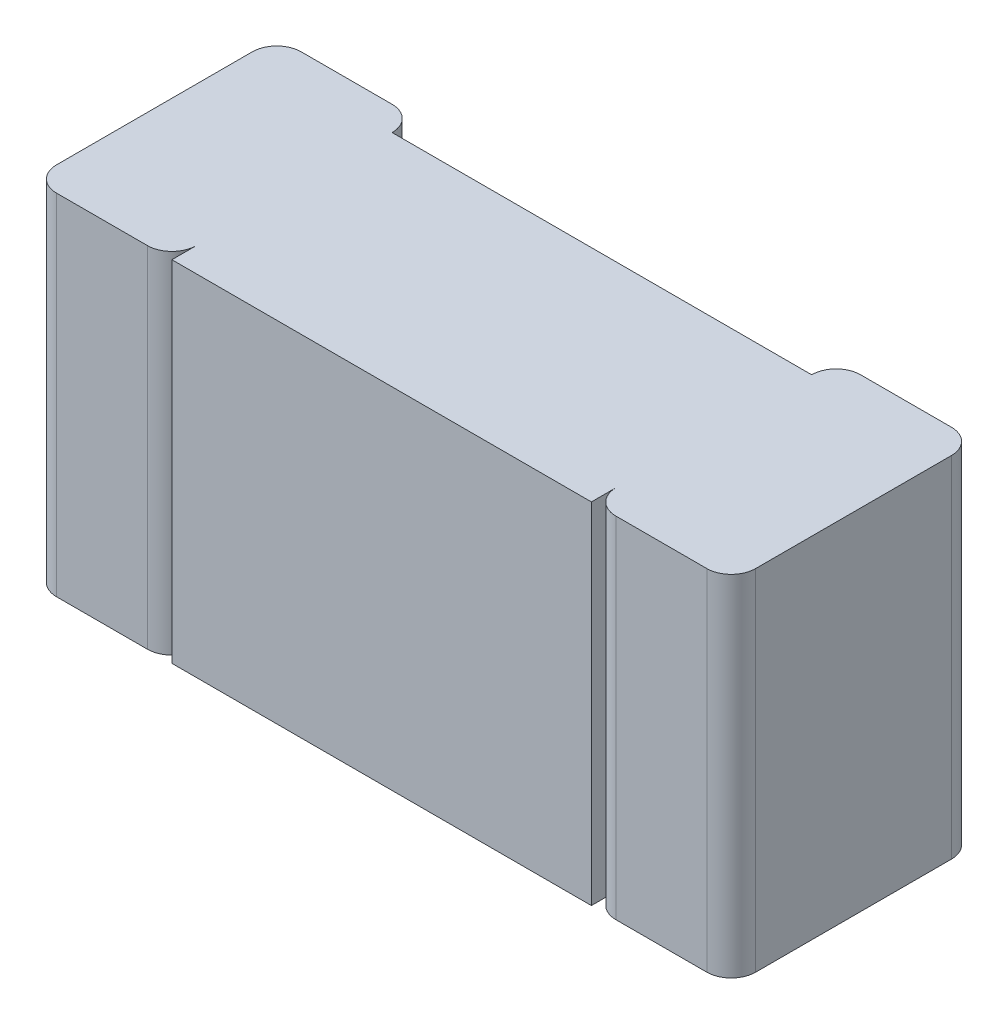
ISO-10303-21;
HEADER;
FILE_DESCRIPTION(('STEP AP214'),'2;1');
FILE_NAME('part.step','',(''),(''),'','','');
FILE_SCHEMA(('AUTOMOTIVE_DESIGN { 1 0 10303 214 1 1 1 1 }'));
ENDSEC;
DATA;
#1=APPLICATION_CONTEXT('core data for automotive mechanical design processes');
#2=APPLICATION_PROTOCOL_DEFINITION('international standard','automotive_design',2000,#1);
#3=PRODUCT_CONTEXT('',#1,'mechanical');
#4=PRODUCT('Part','Part','',(#3));
#5=PRODUCT_RELATED_PRODUCT_CATEGORY('part','',(#4));
#6=PRODUCT_DEFINITION_FORMATION('','',#4);
#7=PRODUCT_DEFINITION_CONTEXT('part definition',#1,'design');
#8=PRODUCT_DEFINITION('design','',#6,#7);
#9=PRODUCT_DEFINITION_SHAPE('','',#8);
#10=(LENGTH_UNIT() NAMED_UNIT(*) SI_UNIT(.MILLI.,.METRE.));
#11=(NAMED_UNIT(*) PLANE_ANGLE_UNIT() SI_UNIT($,.RADIAN.));
#12=(NAMED_UNIT(*) SI_UNIT($,.STERADIAN.) SOLID_ANGLE_UNIT());
#13=UNCERTAINTY_MEASURE_WITH_UNIT(LENGTH_MEASURE(1.E-05),#10,'distance_accuracy_value','');
#14=(GEOMETRIC_REPRESENTATION_CONTEXT(3) GLOBAL_UNCERTAINTY_ASSIGNED_CONTEXT((#13)) GLOBAL_UNIT_ASSIGNED_CONTEXT((#10,
#11,#12)) REPRESENTATION_CONTEXT('',''));
#15=CARTESIAN_POINT('',(0.,0.,0.));
#16=DIRECTION('',(0.,0.,1.));
#17=DIRECTION('',(1.,0.,0.));
#18=AXIS2_PLACEMENT_3D('',#15,#16,#17);
#19=CARTESIAN_POINT('',(-0.465,-0.25,0.035));
#20=DIRECTION('',(0.,1.,0.));
#21=DIRECTION('',(0.,0.,1.));
#22=AXIS2_PLACEMENT_3D('',#19,#20,#21);
#23=CYLINDRICAL_SURFACE('',#22,0.035);
#24=DIRECTION('',(0.,1.,0.));
#25=VECTOR('',#24,1.);
#26=CARTESIAN_POINT('',(-0.465,-0.25,0.));
#27=LINE('',#26,#25);
#28=CARTESIAN_POINT('',(-0.465,0.25,0.));
#29=VERTEX_POINT('',#28);
#30=CARTESIAN_POINT('',(-0.465,-0.25,0.));
#31=VERTEX_POINT('',#30);
#32=EDGE_CURVE('E129',#29,#31,#27,.F.);
#33=ORIENTED_EDGE('',*,*,#32,.T.);
#34=CARTESIAN_POINT('',(-0.465,-0.25,0.035));
#35=DIRECTION('',(0.,1.,0.));
#36=DIRECTION('',(0.,0.,1.));
#37=AXIS2_PLACEMENT_3D('',#34,#35,#36);
#38=CIRCLE('',#37,0.035);
#39=CARTESIAN_POINT('',(-0.5,-0.25,0.035));
#40=VERTEX_POINT('',#39);
#41=EDGE_CURVE('E20',#31,#40,#38,.T.);
#42=ORIENTED_EDGE('',*,*,#41,.T.);
#43=DIRECTION('',(0.,1.,0.));
#44=VECTOR('',#43,1.);
#45=CARTESIAN_POINT('',(-0.5,-0.25,0.035));
#46=LINE('',#45,#44);
#47=CARTESIAN_POINT('',(-0.5,0.25,0.035));
#48=VERTEX_POINT('',#47);
#49=EDGE_CURVE('E136',#40,#48,#46,.T.);
#50=ORIENTED_EDGE('',*,*,#49,.T.);
#51=CARTESIAN_POINT('',(-0.465,0.25,0.035));
#52=DIRECTION('',(0.,1.,0.));
#53=DIRECTION('',(0.,0.,1.));
#54=AXIS2_PLACEMENT_3D('',#51,#52,#53);
#55=CIRCLE('',#54,0.035);
#56=EDGE_CURVE('E232',#29,#48,#55,.T.);
#57=ORIENTED_EDGE('',*,*,#56,.F.);
#58=EDGE_LOOP('',(#33,#42,#50,#57));
#59=FACE_BOUND('',#58,.T.);
#60=ADVANCED_FACE('F17',(#59),#23,.T.);
#61=CARTESIAN_POINT('',(-0.5,-0.25,0.));
#62=DIRECTION('',(1.,0.,0.));
#63=DIRECTION('',(0.,0.,-1.));
#64=AXIS2_PLACEMENT_3D('',#61,#62,#63);
#65=PLANE('',#64);
#66=DIRECTION('',(0.,0.,1.));
#67=VECTOR('',#66,1.);
#68=CARTESIAN_POINT('',(-0.5,0.25,0.));
#69=LINE('',#68,#67);
#70=CARTESIAN_POINT('',(-0.5,0.25,0.315));
#71=VERTEX_POINT('',#70);
#72=EDGE_CURVE('E141',#48,#71,#69,.T.);
#73=ORIENTED_EDGE('',*,*,#72,.F.);
#74=ORIENTED_EDGE('',*,*,#49,.F.);
#75=DIRECTION('',(0.,0.,1.));
#76=VECTOR('',#75,1.);
#77=CARTESIAN_POINT('',(-0.5,-0.25,0.));
#78=LINE('',#77,#76);
#79=CARTESIAN_POINT('',(-0.5,-0.25,0.315));
#80=VERTEX_POINT('',#79);
#81=EDGE_CURVE('E140',#40,#80,#78,.T.);
#82=ORIENTED_EDGE('',*,*,#81,.T.);
#83=DIRECTION('',(0.,1.,0.));
#84=VECTOR('',#83,1.);
#85=CARTESIAN_POINT('',(-0.5,-0.25,0.315));
#86=LINE('',#85,#84);
#87=EDGE_CURVE('E142',#71,#80,#86,.F.);
#88=ORIENTED_EDGE('',*,*,#87,.F.);
#89=EDGE_LOOP('',(#73,#74,#82,#88));
#90=FACE_BOUND('',#89,.T.);
#91=ADVANCED_FACE('F138',(#90),#65,.F.);
#92=CARTESIAN_POINT('',(-0.465,-0.25,0.315));
#93=DIRECTION('',(0.,1.,0.));
#94=DIRECTION('',(0.,0.,1.));
#95=AXIS2_PLACEMENT_3D('',#92,#93,#94);
#96=CYLINDRICAL_SURFACE('',#95,0.035);
#97=CARTESIAN_POINT('',(-0.465,0.25,0.315));
#98=DIRECTION('',(0.,1.,0.));
#99=DIRECTION('',(0.,0.,1.));
#100=AXIS2_PLACEMENT_3D('',#97,#98,#99);
#101=CIRCLE('',#100,0.035);
#102=CARTESIAN_POINT('',(-0.465,0.25,0.35));
#103=VERTEX_POINT('',#102);
#104=EDGE_CURVE('E230',#71,#103,#101,.T.);
#105=ORIENTED_EDGE('',*,*,#104,.F.);
#106=ORIENTED_EDGE('',*,*,#87,.T.);
#107=CARTESIAN_POINT('',(-0.465,-0.25,0.315));
#108=DIRECTION('',(0.,1.,0.));
#109=DIRECTION('',(0.,0.,1.));
#110=AXIS2_PLACEMENT_3D('',#107,#108,#109);
#111=CIRCLE('',#110,0.035);
#112=CARTESIAN_POINT('',(-0.465,-0.25,0.35));
#113=VERTEX_POINT('',#112);
#114=EDGE_CURVE('E151',#80,#113,#111,.T.);
#115=ORIENTED_EDGE('',*,*,#114,.T.);
#116=DIRECTION('',(0.,1.,0.));
#117=VECTOR('',#116,1.);
#118=CARTESIAN_POINT('',(-0.465,-0.25,0.35));
#119=LINE('',#118,#117);
#120=EDGE_CURVE('E200',#103,#113,#119,.F.);
#121=ORIENTED_EDGE('',*,*,#120,.F.);
#122=EDGE_LOOP('',(#105,#106,#115,#121));
#123=FACE_BOUND('',#122,.T.);
#124=ADVANCED_FACE('F452',(#123),#96,.T.);
#125=CARTESIAN_POINT('',(-0.5,-0.25,0.35));
#126=DIRECTION('',(0.,0.,1.));
#127=DIRECTION('',(1.,0.,0.));
#128=AXIS2_PLACEMENT_3D('',#125,#126,#127);
#129=PLANE('',#128);
#130=DIRECTION('',(1.,0.,0.));
#131=VECTOR('',#130,1.);
#132=CARTESIAN_POINT('',(-0.5,-0.25,0.35));
#133=LINE('',#132,#131);
#134=CARTESIAN_POINT('',(-0.335,-0.25,0.35));
#135=VERTEX_POINT('',#134);
#136=EDGE_CURVE('E248',#113,#135,#133,.T.);
#137=ORIENTED_EDGE('',*,*,#136,.T.);
#138=DIRECTION('',(0.,1.,0.));
#139=VECTOR('',#138,1.);
#140=CARTESIAN_POINT('',(-0.335,-0.25,0.35));
#141=LINE('',#140,#139);
#142=CARTESIAN_POINT('',(-0.335,0.25,0.35));
#143=VERTEX_POINT('',#142);
#144=EDGE_CURVE('E198',#143,#135,#141,.F.);
#145=ORIENTED_EDGE('',*,*,#144,.F.);
#146=DIRECTION('',(1.,0.,0.));
#147=VECTOR('',#146,1.);
#148=CARTESIAN_POINT('',(-0.5,0.25,0.35));
#149=LINE('',#148,#147);
#150=EDGE_CURVE('E229',#103,#143,#149,.T.);
#151=ORIENTED_EDGE('',*,*,#150,.F.);
#152=ORIENTED_EDGE('',*,*,#120,.T.);
#153=EDGE_LOOP('',(#137,#145,#151,#152));
#154=FACE_BOUND('',#153,.T.);
#155=ADVANCED_FACE('F442',(#154),#129,.T.);
#156=CARTESIAN_POINT('',(-0.335,-0.25,0.315));
#157=DIRECTION('',(0.,1.,0.));
#158=DIRECTION('',(0.,0.,1.));
#159=AXIS2_PLACEMENT_3D('',#156,#157,#158);
#160=CYLINDRICAL_SURFACE('',#159,0.035);
#161=ORIENTED_EDGE('',*,*,#144,.T.);
#162=CARTESIAN_POINT('',(-0.335,-0.25,0.315));
#163=DIRECTION('',(0.,1.,0.));
#164=DIRECTION('',(0.,0.,1.));
#165=AXIS2_PLACEMENT_3D('',#162,#163,#164);
#166=CIRCLE('',#165,0.035);
#167=CARTESIAN_POINT('',(-0.3,-0.25,0.315));
#168=VERTEX_POINT('',#167);
#169=EDGE_CURVE('E246',#135,#168,#166,.T.);
#170=ORIENTED_EDGE('',*,*,#169,.T.);
#171=DIRECTION('',(0.,1.,0.));
#172=VECTOR('',#171,1.);
#173=CARTESIAN_POINT('',(-0.3,-0.25,0.315));
#174=LINE('',#173,#172);
#175=CARTESIAN_POINT('',(-0.3,0.25,0.315));
#176=VERTEX_POINT('',#175);
#177=EDGE_CURVE('E193',#168,#176,#174,.T.);
#178=ORIENTED_EDGE('',*,*,#177,.T.);
#179=CARTESIAN_POINT('',(-0.335,0.25,0.315));
#180=DIRECTION('',(0.,1.,0.));
#181=DIRECTION('',(0.,0.,1.));
#182=AXIS2_PLACEMENT_3D('',#179,#180,#181);
#183=CIRCLE('',#182,0.035);
#184=EDGE_CURVE('E227',#143,#176,#183,.T.);
#185=ORIENTED_EDGE('',*,*,#184,.F.);
#186=EDGE_LOOP('',(#161,#170,#178,#185));
#187=FACE_BOUND('',#186,.T.);
#188=ADVANCED_FACE('F430',(#187),#160,.T.);
#189=CARTESIAN_POINT('',(-0.3,-0.25,0.315));
#190=DIRECTION('',(1.,0.,0.));
#191=DIRECTION('',(0.,0.,-1.));
#192=AXIS2_PLACEMENT_3D('',#189,#190,#191);
#193=PLANE('',#192);
#194=DIRECTION('',(0.,0.,1.));
#195=VECTOR('',#194,1.);
#196=CARTESIAN_POINT('',(-0.3,0.25,0.315));
#197=LINE('',#196,#195);
#198=CARTESIAN_POINT('',(-0.3,0.25,0.35));
#199=VERTEX_POINT('',#198);
#200=EDGE_CURVE('E188',#176,#199,#197,.T.);
#201=ORIENTED_EDGE('',*,*,#200,.F.);
#202=ORIENTED_EDGE('',*,*,#177,.F.);
#203=DIRECTION('',(0.,0.,1.));
#204=VECTOR('',#203,1.);
#205=CARTESIAN_POINT('',(-0.3,-0.25,0.315));
#206=LINE('',#205,#204);
#207=CARTESIAN_POINT('',(-0.3,-0.25,0.35));
#208=VERTEX_POINT('',#207);
#209=EDGE_CURVE('E206',#168,#208,#206,.T.);
#210=ORIENTED_EDGE('',*,*,#209,.T.);
#211=DIRECTION('',(0.,1.,0.));
#212=VECTOR('',#211,1.);
#213=CARTESIAN_POINT('',(-0.3,-0.25,0.35));
#214=LINE('',#213,#212);
#215=EDGE_CURVE('E181',#199,#208,#214,.F.);
#216=ORIENTED_EDGE('',*,*,#215,.F.);
#217=EDGE_LOOP('',(#201,#202,#210,#216));
#218=FACE_BOUND('',#217,.T.);
#219=ADVANCED_FACE('F420',(#218),#193,.F.);
#220=CARTESIAN_POINT('',(-0.3,-0.25,0.35));
#221=DIRECTION('',(0.,0.,1.));
#222=DIRECTION('',(1.,0.,0.));
#223=AXIS2_PLACEMENT_3D('',#220,#221,#222);
#224=PLANE('',#223);
#225=DIRECTION('',(0.,1.,0.));
#226=VECTOR('',#225,1.);
#227=CARTESIAN_POINT('',(0.3,-0.25,0.35));
#228=LINE('',#227,#226);
#229=CARTESIAN_POINT('',(0.3,0.25,0.35));
#230=VERTEX_POINT('',#229);
#231=CARTESIAN_POINT('',(0.3,-0.25,0.35));
#232=VERTEX_POINT('',#231);
#233=EDGE_CURVE('E174',#230,#232,#228,.F.);
#234=ORIENTED_EDGE('',*,*,#233,.F.);
#235=DIRECTION('',(1.,0.,0.));
#236=VECTOR('',#235,1.);
#237=CARTESIAN_POINT('',(-0.3,0.25,0.35));
#238=LINE('',#237,#236);
#239=EDGE_CURVE('E184',#199,#230,#238,.T.);
#240=ORIENTED_EDGE('',*,*,#239,.F.);
#241=ORIENTED_EDGE('',*,*,#215,.T.);
#242=DIRECTION('',(1.,0.,0.));
#243=VECTOR('',#242,1.);
#244=CARTESIAN_POINT('',(-0.3,-0.25,0.35));
#245=LINE('',#244,#243);
#246=EDGE_CURVE('E203',#208,#232,#245,.T.);
#247=ORIENTED_EDGE('',*,*,#246,.T.);
#248=EDGE_LOOP('',(#234,#240,#241,#247));
#249=FACE_BOUND('',#248,.T.);
#250=ADVANCED_FACE('F407',(#249),#224,.T.);
#251=CARTESIAN_POINT('',(0.3,-0.25,0.315));
#252=DIRECTION('',(1.,0.,0.));
#253=DIRECTION('',(0.,0.,-1.));
#254=AXIS2_PLACEMENT_3D('',#251,#252,#253);
#255=PLANE('',#254);
#256=DIRECTION('',(0.,0.,1.));
#257=VECTOR('',#256,1.);
#258=CARTESIAN_POINT('',(0.3,0.25,0.315));
#259=LINE('',#258,#257);
#260=CARTESIAN_POINT('',(0.3,0.25,0.315));
#261=VERTEX_POINT('',#260);
#262=EDGE_CURVE('E187',#230,#261,#259,.F.);
#263=ORIENTED_EDGE('',*,*,#262,.F.);
#264=ORIENTED_EDGE('',*,*,#233,.T.);
#265=DIRECTION('',(0.,0.,1.));
#266=VECTOR('',#265,1.);
#267=CARTESIAN_POINT('',(0.3,-0.25,0.315));
#268=LINE('',#267,#266);
#269=CARTESIAN_POINT('',(0.3,-0.25,0.315));
#270=VERTEX_POINT('',#269);
#271=EDGE_CURVE('E178',#232,#270,#268,.F.);
#272=ORIENTED_EDGE('',*,*,#271,.T.);
#273=DIRECTION('',(0.,1.,0.));
#274=VECTOR('',#273,1.);
#275=CARTESIAN_POINT('',(0.3,-0.25,0.315));
#276=LINE('',#275,#274);
#277=EDGE_CURVE('E172',#261,#270,#276,.F.);
#278=ORIENTED_EDGE('',*,*,#277,.F.);
#279=EDGE_LOOP('',(#263,#264,#272,#278));
#280=FACE_BOUND('',#279,.T.);
#281=ADVANCED_FACE('F375',(#280),#255,.T.);
#282=CARTESIAN_POINT('',(0.335,-0.25,0.315));
#283=DIRECTION('',(0.,1.,0.));
#284=DIRECTION('',(0.,0.,1.));
#285=AXIS2_PLACEMENT_3D('',#282,#283,#284);
#286=CYLINDRICAL_SURFACE('',#285,0.035);
#287=CARTESIAN_POINT('',(0.335,0.25,0.315));
#288=DIRECTION('',(0.,1.,0.));
#289=DIRECTION('',(0.,0.,1.));
#290=AXIS2_PLACEMENT_3D('',#287,#288,#289);
#291=CIRCLE('',#290,0.035);
#292=CARTESIAN_POINT('',(0.335,0.25,0.35));
#293=VERTEX_POINT('',#292);
#294=EDGE_CURVE('E224',#261,#293,#291,.T.);
#295=ORIENTED_EDGE('',*,*,#294,.F.);
#296=ORIENTED_EDGE('',*,*,#277,.T.);
#297=CARTESIAN_POINT('',(0.335,-0.25,0.315));
#298=DIRECTION('',(0.,1.,0.));
#299=DIRECTION('',(0.,0.,1.));
#300=AXIS2_PLACEMENT_3D('',#297,#298,#299);
#301=CIRCLE('',#300,0.035);
#302=CARTESIAN_POINT('',(0.335,-0.25,0.35));
#303=VERTEX_POINT('',#302);
#304=EDGE_CURVE('E243',#270,#303,#301,.T.);
#305=ORIENTED_EDGE('',*,*,#304,.T.);
#306=DIRECTION('',(0.,1.,0.));
#307=VECTOR('',#306,1.);
#308=CARTESIAN_POINT('',(0.335,-0.25,0.35));
#309=LINE('',#308,#307);
#310=EDGE_CURVE('E170',#293,#303,#309,.F.);
#311=ORIENTED_EDGE('',*,*,#310,.F.);
#312=EDGE_LOOP('',(#295,#296,#305,#311));
#313=FACE_BOUND('',#312,.T.);
#314=ADVANCED_FACE('F406',(#313),#286,.T.);
#315=CARTESIAN_POINT('',(0.3,-0.25,0.35));
#316=DIRECTION('',(0.,0.,1.));
#317=DIRECTION('',(1.,0.,0.));
#318=AXIS2_PLACEMENT_3D('',#315,#316,#317);
#319=PLANE('',#318);
#320=DIRECTION('',(1.,0.,0.));
#321=VECTOR('',#320,1.);
#322=CARTESIAN_POINT('',(0.3,-0.25,0.35));
#323=LINE('',#322,#321);
#324=CARTESIAN_POINT('',(0.465,-0.25,0.35));
#325=VERTEX_POINT('',#324);
#326=EDGE_CURVE('E242',#303,#325,#323,.T.);
#327=ORIENTED_EDGE('',*,*,#326,.T.);
#328=DIRECTION('',(0.,1.,0.));
#329=VECTOR('',#328,1.);
#330=CARTESIAN_POINT('',(0.465,-0.25,0.35));
#331=LINE('',#330,#329);
#332=CARTESIAN_POINT('',(0.465,0.25,0.35));
#333=VERTEX_POINT('',#332);
#334=EDGE_CURVE('E168',#333,#325,#331,.F.);
#335=ORIENTED_EDGE('',*,*,#334,.F.);
#336=DIRECTION('',(1.,0.,0.));
#337=VECTOR('',#336,1.);
#338=CARTESIAN_POINT('',(0.3,0.25,0.35));
#339=LINE('',#338,#337);
#340=EDGE_CURVE('E223',#293,#333,#339,.T.);
#341=ORIENTED_EDGE('',*,*,#340,.F.);
#342=ORIENTED_EDGE('',*,*,#310,.T.);
#343=EDGE_LOOP('',(#327,#335,#341,#342));
#344=FACE_BOUND('',#343,.T.);
#345=ADVANCED_FACE('F483',(#344),#319,.T.);
#346=CARTESIAN_POINT('',(0.465,-0.25,0.315));
#347=DIRECTION('',(0.,1.,0.));
#348=DIRECTION('',(0.,0.,1.));
#349=AXIS2_PLACEMENT_3D('',#346,#347,#348);
#350=CYLINDRICAL_SURFACE('',#349,0.035);
#351=ORIENTED_EDGE('',*,*,#334,.T.);
#352=CARTESIAN_POINT('',(0.465,-0.25,0.315));
#353=DIRECTION('',(0.,1.,0.));
#354=DIRECTION('',(0.,0.,1.));
#355=AXIS2_PLACEMENT_3D('',#352,#353,#354);
#356=CIRCLE('',#355,0.035);
#357=CARTESIAN_POINT('',(0.5,-0.25,0.315));
#358=VERTEX_POINT('',#357);
#359=EDGE_CURVE('E239',#325,#358,#356,.T.);
#360=ORIENTED_EDGE('',*,*,#359,.T.);
#361=DIRECTION('',(0.,1.,0.));
#362=VECTOR('',#361,1.);
#363=CARTESIAN_POINT('',(0.5,-0.25,0.315));
#364=LINE('',#363,#362);
#365=CARTESIAN_POINT('',(0.5,0.25,0.315));
#366=VERTEX_POINT('',#365);
#367=EDGE_CURVE('E166',#366,#358,#364,.F.);
#368=ORIENTED_EDGE('',*,*,#367,.F.);
#369=CARTESIAN_POINT('',(0.465,0.25,0.315));
#370=DIRECTION('',(0.,1.,0.));
#371=DIRECTION('',(0.,0.,1.));
#372=AXIS2_PLACEMENT_3D('',#369,#370,#371);
#373=CIRCLE('',#372,0.035);
#374=EDGE_CURVE('E221',#333,#366,#373,.T.);
#375=ORIENTED_EDGE('',*,*,#374,.F.);
#376=EDGE_LOOP('',(#351,#360,#368,#375));
#377=FACE_BOUND('',#376,.T.);
#378=ADVANCED_FACE('F487',(#377),#350,.T.);
#379=CARTESIAN_POINT('',(0.5,-0.25,0.));
#380=DIRECTION('',(1.,0.,0.));
#381=DIRECTION('',(0.,0.,-1.));
#382=AXIS2_PLACEMENT_3D('',#379,#380,#381);
#383=PLANE('',#382);
#384=DIRECTION('',(0.,0.,1.));
#385=VECTOR('',#384,1.);
#386=CARTESIAN_POINT('',(0.5,0.25,0.));
#387=LINE('',#386,#385);
#388=CARTESIAN_POINT('',(0.5,0.25,0.035));
#389=VERTEX_POINT('',#388);
#390=EDGE_CURVE('E220',#366,#389,#387,.F.);
#391=ORIENTED_EDGE('',*,*,#390,.F.);
#392=ORIENTED_EDGE('',*,*,#367,.T.);
#393=DIRECTION('',(0.,0.,1.));
#394=VECTOR('',#393,1.);
#395=CARTESIAN_POINT('',(0.5,-0.25,0.));
#396=LINE('',#395,#394);
#397=CARTESIAN_POINT('',(0.5,-0.25,0.035));
#398=VERTEX_POINT('',#397);
#399=EDGE_CURVE('E238',#358,#398,#396,.F.);
#400=ORIENTED_EDGE('',*,*,#399,.T.);
#401=DIRECTION('',(0.,1.,0.));
#402=VECTOR('',#401,1.);
#403=CARTESIAN_POINT('',(0.5,-0.25,0.035));
#404=LINE('',#403,#402);
#405=EDGE_CURVE('E157',#389,#398,#404,.F.);
#406=ORIENTED_EDGE('',*,*,#405,.F.);
#407=EDGE_LOOP('',(#391,#392,#400,#406));
#408=FACE_BOUND('',#407,.T.);
#409=ADVANCED_FACE('F298',(#408),#383,.T.);
#410=CARTESIAN_POINT('',(0.465,-0.25,0.035));
#411=DIRECTION('',(0.,1.,0.));
#412=DIRECTION('',(0.,0.,1.));
#413=AXIS2_PLACEMENT_3D('',#410,#411,#412);
#414=CYLINDRICAL_SURFACE('',#413,0.035);
#415=CARTESIAN_POINT('',(0.465,0.25,0.035));
#416=DIRECTION('',(0.,1.,0.));
#417=DIRECTION('',(0.,0.,1.));
#418=AXIS2_PLACEMENT_3D('',#415,#416,#417);
#419=CIRCLE('',#418,0.035);
#420=CARTESIAN_POINT('',(0.465,0.25,0.));
#421=VERTEX_POINT('',#420);
#422=EDGE_CURVE('E217',#389,#421,#419,.T.);
#423=ORIENTED_EDGE('',*,*,#422,.F.);
#424=ORIENTED_EDGE('',*,*,#405,.T.);
#425=CARTESIAN_POINT('',(0.465,-0.25,0.035));
#426=DIRECTION('',(0.,1.,0.));
#427=DIRECTION('',(0.,0.,1.));
#428=AXIS2_PLACEMENT_3D('',#425,#426,#427);
#429=CIRCLE('',#428,0.035);
#430=CARTESIAN_POINT('',(0.465,-0.25,0.));
#431=VERTEX_POINT('',#430);
#432=EDGE_CURVE('E235',#398,#431,#429,.T.);
#433=ORIENTED_EDGE('',*,*,#432,.T.);
#434=DIRECTION('',(0.,1.,0.));
#435=VECTOR('',#434,1.);
#436=CARTESIAN_POINT('',(0.465,-0.25,0.));
#437=LINE('',#436,#435);
#438=EDGE_CURVE('E175',#431,#421,#437,.T.);
#439=ORIENTED_EDGE('',*,*,#438,.T.);
#440=EDGE_LOOP('',(#423,#424,#433,#439));
#441=FACE_BOUND('',#440,.T.);
#442=ADVANCED_FACE('F302',(#441),#414,.T.);
#443=CARTESIAN_POINT('',(-0.5,-0.25,0.));
#444=DIRECTION('',(0.,0.,1.));
#445=DIRECTION('',(1.,0.,0.));
#446=AXIS2_PLACEMENT_3D('',#443,#444,#445);
#447=PLANE('',#446);
#448=DIRECTION('',(1.,0.,0.));
#449=VECTOR('',#448,1.);
#450=CARTESIAN_POINT('',(-0.5,-0.25,0.));
#451=LINE('',#450,#449);
#452=CARTESIAN_POINT('',(-0.335,-0.25,0.));
#453=VERTEX_POINT('',#452);
#454=EDGE_CURVE('E153',#453,#31,#451,.F.);
#455=ORIENTED_EDGE('',*,*,#454,.T.);
#456=ORIENTED_EDGE('',*,*,#32,.F.);
#457=DIRECTION('',(1.,0.,0.));
#458=VECTOR('',#457,1.);
#459=CARTESIAN_POINT('',(-0.5,0.25,0.));
#460=LINE('',#459,#458);
#461=CARTESIAN_POINT('',(-0.335,0.25,0.));
#462=VERTEX_POINT('',#461);
#463=EDGE_CURVE('E234',#462,#29,#460,.F.);
#464=ORIENTED_EDGE('',*,*,#463,.F.);
#465=DIRECTION('',(0.,1.,0.));
#466=VECTOR('',#465,1.);
#467=CARTESIAN_POINT('',(-0.335,-0.25,0.));
#468=LINE('',#467,#466);
#469=EDGE_CURVE('E161',#453,#462,#468,.T.);
#470=ORIENTED_EDGE('',*,*,#469,.F.);
#471=EDGE_LOOP('',(#455,#456,#464,#470));
#472=FACE_BOUND('',#471,.T.);
#473=ADVANCED_FACE('F319',(#472),#447,.F.);
#474=CARTESIAN_POINT('',(0.3,-0.25,0.));
#475=DIRECTION('',(0.,0.,1.));
#476=DIRECTION('',(1.,0.,0.));
#477=AXIS2_PLACEMENT_3D('',#474,#475,#476);
#478=PLANE('',#477);
#479=DIRECTION('',(1.,0.,0.));
#480=VECTOR('',#479,1.);
#481=CARTESIAN_POINT('',(0.3,-0.25,0.));
#482=LINE('',#481,#480);
#483=CARTESIAN_POINT('',(0.335,-0.25,0.));
#484=VERTEX_POINT('',#483);
#485=EDGE_CURVE('E177',#431,#484,#482,.F.);
#486=ORIENTED_EDGE('',*,*,#485,.T.);
#487=DIRECTION('',(0.,1.,0.));
#488=VECTOR('',#487,1.);
#489=CARTESIAN_POINT('',(0.335,-0.25,0.));
#490=LINE('',#489,#488);
#491=CARTESIAN_POINT('',(0.335,0.25,0.));
#492=VERTEX_POINT('',#491);
#493=EDGE_CURVE('E212',#492,#484,#490,.F.);
#494=ORIENTED_EDGE('',*,*,#493,.F.);
#495=DIRECTION('',(1.,0.,0.));
#496=VECTOR('',#495,1.);
#497=CARTESIAN_POINT('',(0.3,0.25,0.));
#498=LINE('',#497,#496);
#499=EDGE_CURVE('E226',#421,#492,#498,.F.);
#500=ORIENTED_EDGE('',*,*,#499,.F.);
#501=ORIENTED_EDGE('',*,*,#438,.F.);
#502=EDGE_LOOP('',(#486,#494,#500,#501));
#503=FACE_BOUND('',#502,.T.);
#504=ADVANCED_FACE('F305',(#503),#478,.F.);
#505=CARTESIAN_POINT('',(-0.335,-0.25,0.035));
#506=DIRECTION('',(0.,1.,0.));
#507=DIRECTION('',(0.,0.,1.));
#508=AXIS2_PLACEMENT_3D('',#505,#506,#507);
#509=CYLINDRICAL_SURFACE('',#508,0.035);
#510=CARTESIAN_POINT('',(-0.335,0.25,0.035));
#511=DIRECTION('',(0.,1.,0.));
#512=DIRECTION('',(0.,0.,1.));
#513=AXIS2_PLACEMENT_3D('',#510,#511,#512);
#514=CIRCLE('',#513,0.035);
#515=CARTESIAN_POINT('',(-0.3,0.25,0.035));
#516=VERTEX_POINT('',#515);
#517=EDGE_CURVE('E163',#462,#516,#514,.F.);
#518=ORIENTED_EDGE('',*,*,#517,.T.);
#519=DIRECTION('',(0.,1.,0.));
#520=VECTOR('',#519,1.);
#521=CARTESIAN_POINT('',(-0.3,-0.25,0.035));
#522=LINE('',#521,#520);
#523=CARTESIAN_POINT('',(-0.3,-0.25,0.035));
#524=VERTEX_POINT('',#523);
#525=EDGE_CURVE('E211',#516,#524,#522,.F.);
#526=ORIENTED_EDGE('',*,*,#525,.T.);
#527=CARTESIAN_POINT('',(-0.335,-0.25,0.035));
#528=DIRECTION('',(0.,1.,0.));
#529=DIRECTION('',(0.,0.,1.));
#530=AXIS2_PLACEMENT_3D('',#527,#528,#529);
#531=CIRCLE('',#530,0.035);
#532=EDGE_CURVE('E164',#524,#453,#531,.T.);
#533=ORIENTED_EDGE('',*,*,#532,.T.);
#534=ORIENTED_EDGE('',*,*,#469,.T.);
#535=EDGE_LOOP('',(#518,#526,#533,#534));
#536=FACE_BOUND('',#535,.T.);
#537=ADVANCED_FACE('F318',(#536),#509,.T.);
#538=CARTESIAN_POINT('',(-0.465,-0.25,0.035));
#539=DIRECTION('',(0.,1.,0.));
#540=DIRECTION('',(0.,0.,1.));
#541=AXIS2_PLACEMENT_3D('',#538,#539,#540);
#542=PLANE('',#541);
#543=DIRECTION('',(1.,0.,0.));
#544=VECTOR('',#543,1.);
#545=CARTESIAN_POINT('',(-0.465,-0.25,0.035));
#546=LINE('',#545,#544);
#547=CARTESIAN_POINT('',(0.3,-0.25,0.035));
#548=VERTEX_POINT('',#547);
#549=EDGE_CURVE('E263',#524,#548,#546,.T.);
#550=ORIENTED_EDGE('',*,*,#549,.T.);
#551=CARTESIAN_POINT('',(0.335,-0.25,0.035));
#552=DIRECTION('',(0.,1.,0.));
#553=DIRECTION('',(0.,0.,1.));
#554=AXIS2_PLACEMENT_3D('',#551,#552,#553);
#555=CIRCLE('',#554,0.035);
#556=EDGE_CURVE('E209',#484,#548,#555,.T.);
#557=ORIENTED_EDGE('',*,*,#556,.F.);
#558=ORIENTED_EDGE('',*,*,#485,.F.);
#559=ORIENTED_EDGE('',*,*,#432,.F.);
#560=ORIENTED_EDGE('',*,*,#399,.F.);
#561=ORIENTED_EDGE('',*,*,#359,.F.);
#562=ORIENTED_EDGE('',*,*,#326,.F.);
#563=ORIENTED_EDGE('',*,*,#304,.F.);
#564=ORIENTED_EDGE('',*,*,#271,.F.);
#565=ORIENTED_EDGE('',*,*,#246,.F.);
#566=ORIENTED_EDGE('',*,*,#209,.F.);
#567=ORIENTED_EDGE('',*,*,#169,.F.);
#568=ORIENTED_EDGE('',*,*,#136,.F.);
#569=ORIENTED_EDGE('',*,*,#114,.F.);
#570=ORIENTED_EDGE('',*,*,#81,.F.);
#571=ORIENTED_EDGE('',*,*,#41,.F.);
#572=ORIENTED_EDGE('',*,*,#454,.F.);
#573=ORIENTED_EDGE('',*,*,#532,.F.);
#574=EDGE_LOOP('',(#550,#557,#558,#559,#560,#561,#562,#563,#564,#565,#566,#567,#568,#569,#570,
#571,#572,#573));
#575=FACE_BOUND('',#574,.T.);
#576=ADVANCED_FACE('F147',(#575),#542,.F.);
#577=CARTESIAN_POINT('',(0.335,-0.25,0.035));
#578=DIRECTION('',(0.,1.,0.));
#579=DIRECTION('',(0.,0.,1.));
#580=AXIS2_PLACEMENT_3D('',#577,#578,#579);
#581=CYLINDRICAL_SURFACE('',#580,0.035);
#582=ORIENTED_EDGE('',*,*,#493,.T.);
#583=ORIENTED_EDGE('',*,*,#556,.T.);
#584=DIRECTION('',(0.,1.,0.));
#585=VECTOR('',#584,1.);
#586=CARTESIAN_POINT('',(0.3,-0.25,0.035));
#587=LINE('',#586,#585);
#588=CARTESIAN_POINT('',(0.3,0.25,0.035));
#589=VERTEX_POINT('',#588);
#590=EDGE_CURVE('E26',#548,#589,#587,.T.);
#591=ORIENTED_EDGE('',*,*,#590,.T.);
#592=CARTESIAN_POINT('',(0.335,0.25,0.035));
#593=DIRECTION('',(0.,1.,0.));
#594=DIRECTION('',(0.,0.,1.));
#595=AXIS2_PLACEMENT_3D('',#592,#593,#594);
#596=CIRCLE('',#595,0.035);
#597=EDGE_CURVE('E34',#589,#492,#596,.F.);
#598=ORIENTED_EDGE('',*,*,#597,.T.);
#599=EDGE_LOOP('',(#582,#583,#591,#598));
#600=FACE_BOUND('',#599,.T.);
#601=ADVANCED_FACE('F311',(#600),#581,.T.);
#602=CARTESIAN_POINT('',(-0.465,0.25,0.035));
#603=DIRECTION('',(0.,1.,0.));
#604=DIRECTION('',(0.,0.,1.));
#605=AXIS2_PLACEMENT_3D('',#602,#603,#604);
#606=PLANE('',#605);
#607=DIRECTION('',(1.,0.,0.));
#608=VECTOR('',#607,1.);
#609=CARTESIAN_POINT('',(-0.465,0.25,0.035));
#610=LINE('',#609,#608);
#611=EDGE_CURVE('E11',#589,#516,#610,.F.);
#612=ORIENTED_EDGE('',*,*,#611,.T.);
#613=ORIENTED_EDGE('',*,*,#517,.F.);
#614=ORIENTED_EDGE('',*,*,#463,.T.);
#615=ORIENTED_EDGE('',*,*,#56,.T.);
#616=ORIENTED_EDGE('',*,*,#72,.T.);
#617=ORIENTED_EDGE('',*,*,#104,.T.);
#618=ORIENTED_EDGE('',*,*,#150,.T.);
#619=ORIENTED_EDGE('',*,*,#184,.T.);
#620=ORIENTED_EDGE('',*,*,#200,.T.);
#621=ORIENTED_EDGE('',*,*,#239,.T.);
#622=ORIENTED_EDGE('',*,*,#262,.T.);
#623=ORIENTED_EDGE('',*,*,#294,.T.);
#624=ORIENTED_EDGE('',*,*,#340,.T.);
#625=ORIENTED_EDGE('',*,*,#374,.T.);
#626=ORIENTED_EDGE('',*,*,#390,.T.);
#627=ORIENTED_EDGE('',*,*,#422,.T.);
#628=ORIENTED_EDGE('',*,*,#499,.T.);
#629=ORIENTED_EDGE('',*,*,#597,.F.);
#630=EDGE_LOOP('',(#612,#613,#614,#615,#616,#617,#618,#619,#620,#621,#622,#623,#624,#625,#626,
#627,#628,#629));
#631=FACE_BOUND('',#630,.T.);
#632=ADVANCED_FACE('F292',(#631),#606,.T.);
#633=CARTESIAN_POINT('',(-0.465,-0.25,0.035));
#634=DIRECTION('',(0.,0.,1.));
#635=DIRECTION('',(1.,0.,0.));
#636=AXIS2_PLACEMENT_3D('',#633,#634,#635);
#637=PLANE('',#636);
#638=ORIENTED_EDGE('',*,*,#590,.F.);
#639=ORIENTED_EDGE('',*,*,#549,.F.);
#640=ORIENTED_EDGE('',*,*,#525,.F.);
#641=ORIENTED_EDGE('',*,*,#611,.F.);
#642=EDGE_LOOP('',(#638,#639,#640,#641));
#643=FACE_BOUND('',#642,.T.);
#644=ADVANCED_FACE('F313',(#643),#637,.F.);
#645=CLOSED_SHELL('',(#60,#91,#124,#155,#188,#219,#250,#281,#314,#345,#378,#409,#442,#473,#504,
#537,#576,#601,#632,#644));
#646=MANIFOLD_SOLID_BREP('B1',#645);
#647=ADVANCED_BREP_SHAPE_REPRESENTATION('',(#18,#646),#14);
#648=SHAPE_DEFINITION_REPRESENTATION(#9,#647);
ENDSEC;
END-ISO-10303-21;
